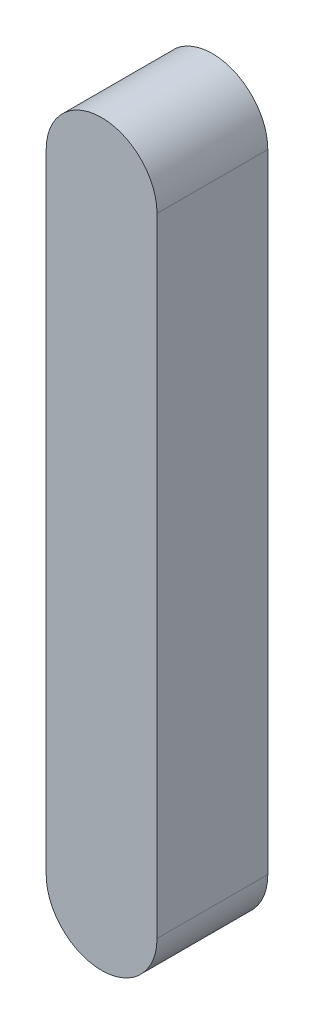
ISO-10303-21;
HEADER;
FILE_DESCRIPTION(('STEP AP214'),'2;1');
FILE_NAME('part.step','',(''),(''),'','','');
FILE_SCHEMA(('AUTOMOTIVE_DESIGN { 1 0 10303 214 1 1 1 1 }'));
ENDSEC;
DATA;
#1=APPLICATION_CONTEXT('core data for automotive mechanical design processes');
#2=APPLICATION_PROTOCOL_DEFINITION('international standard','automotive_design',2000,#1);
#3=PRODUCT_CONTEXT('',#1,'mechanical');
#4=PRODUCT('Part','Part','',(#3));
#5=PRODUCT_RELATED_PRODUCT_CATEGORY('part','',(#4));
#6=PRODUCT_DEFINITION_FORMATION('','',#4);
#7=PRODUCT_DEFINITION_CONTEXT('part definition',#1,'design');
#8=PRODUCT_DEFINITION('design','',#6,#7);
#9=PRODUCT_DEFINITION_SHAPE('','',#8);
#10=(LENGTH_UNIT() NAMED_UNIT(*) SI_UNIT(.MILLI.,.METRE.));
#11=(NAMED_UNIT(*) PLANE_ANGLE_UNIT() SI_UNIT($,.RADIAN.));
#12=(NAMED_UNIT(*) SI_UNIT($,.STERADIAN.) SOLID_ANGLE_UNIT());
#13=UNCERTAINTY_MEASURE_WITH_UNIT(LENGTH_MEASURE(1.E-05),#10,'distance_accuracy_value','');
#14=(GEOMETRIC_REPRESENTATION_CONTEXT(3) GLOBAL_UNCERTAINTY_ASSIGNED_CONTEXT((#13)) GLOBAL_UNIT_ASSIGNED_CONTEXT((#10,
#11,#12)) REPRESENTATION_CONTEXT('',''));
#15=CARTESIAN_POINT('',(0.,0.,0.));
#16=DIRECTION('',(0.,0.,1.));
#17=DIRECTION('',(1.,0.,0.));
#18=AXIS2_PLACEMENT_3D('',#15,#16,#17);
#19=CARTESIAN_POINT('',(80.2001568482512,56.8998914127491,6.));
#20=DIRECTION('',(1.,0.,0.));
#21=DIRECTION('',(0.,0.,-1.));
#22=AXIS2_PLACEMENT_3D('',#19,#20,#21);
#23=PLANE('',#22);
#24=DIRECTION('',(0.,-1.,0.));
#25=VECTOR('',#24,1.);
#26=CARTESIAN_POINT('',(80.2001568482512,56.8998914127491,0.));
#27=LINE('',#26,#25);
#28=CARTESIAN_POINT('',(80.2001568482512,56.8998914127491,0.));
#29=VERTEX_POINT('',#28);
#30=CARTESIAN_POINT('',(80.2001568482512,22.8998914127491,0.));
#31=VERTEX_POINT('',#30);
#32=EDGE_CURVE('E115',#29,#31,#27,.T.);
#33=ORIENTED_EDGE('',*,*,#32,.F.);
#34=DIRECTION('',(0.,0.,-1.));
#35=VECTOR('',#34,1.);
#36=CARTESIAN_POINT('',(80.2001568482512,56.8998914127491,6.));
#37=LINE('',#36,#35);
#38=CARTESIAN_POINT('',(80.2001568482512,56.8998914127491,6.));
#39=VERTEX_POINT('',#38);
#40=EDGE_CURVE('E11',#39,#29,#37,.T.);
#41=ORIENTED_EDGE('',*,*,#40,.F.);
#42=DIRECTION('',(0.,-1.,0.));
#43=VECTOR('',#42,1.);
#44=CARTESIAN_POINT('',(80.2001568482512,56.8998914127491,6.));
#45=LINE('',#44,#43);
#46=CARTESIAN_POINT('',(80.2001568482512,22.8998914127491,6.));
#47=VERTEX_POINT('',#46);
#48=EDGE_CURVE('E108',#39,#47,#45,.T.);
#49=ORIENTED_EDGE('',*,*,#48,.T.);
#50=DIRECTION('',(0.,0.,-1.));
#51=VECTOR('',#50,1.);
#52=CARTESIAN_POINT('',(80.2001568482512,22.8998914127491,6.));
#53=LINE('',#52,#51);
#54=EDGE_CURVE('E39',#47,#31,#53,.T.);
#55=ORIENTED_EDGE('',*,*,#54,.T.);
#56=EDGE_LOOP('',(#33,#41,#49,#55));
#57=FACE_BOUND('',#56,.T.);
#58=ADVANCED_FACE('F36',(#57),#23,.T.);
#59=CARTESIAN_POINT('',(77.2001568482512,56.8998914127491,6.));
#60=DIRECTION('',(0.,0.,-1.));
#61=DIRECTION('',(-1.,0.,0.));
#62=AXIS2_PLACEMENT_3D('',#59,#60,#61);
#63=CYLINDRICAL_SURFACE('',#62,2.99999999999999);
#64=CARTESIAN_POINT('',(77.2001568482512,56.8998914127491,0.));
#65=DIRECTION('',(0.,0.,1.));
#66=DIRECTION('',(1.,0.,0.));
#67=AXIS2_PLACEMENT_3D('',#64,#65,#66);
#68=CIRCLE('',#67,2.99999999999999);
#69=CARTESIAN_POINT('',(74.2001568482512,56.8998914127491,0.));
#70=VERTEX_POINT('',#69);
#71=EDGE_CURVE('E77',#29,#70,#68,.T.);
#72=ORIENTED_EDGE('',*,*,#71,.T.);
#73=DIRECTION('',(0.,0.,-1.));
#74=VECTOR('',#73,1.);
#75=CARTESIAN_POINT('',(74.2001568482512,56.8998914127491,6.));
#76=LINE('',#75,#74);
#77=CARTESIAN_POINT('',(74.2001568482512,56.8998914127491,6.));
#78=VERTEX_POINT('',#77);
#79=EDGE_CURVE('E46',#78,#70,#76,.T.);
#80=ORIENTED_EDGE('',*,*,#79,.F.);
#81=CARTESIAN_POINT('',(77.2001568482512,56.8998914127491,6.));
#82=DIRECTION('',(0.,0.,1.));
#83=DIRECTION('',(1.,0.,0.));
#84=AXIS2_PLACEMENT_3D('',#81,#82,#83);
#85=CIRCLE('',#84,2.99999999999999);
#86=EDGE_CURVE('E93',#39,#78,#85,.T.);
#87=ORIENTED_EDGE('',*,*,#86,.F.);
#88=ORIENTED_EDGE('',*,*,#40,.T.);
#89=EDGE_LOOP('',(#72,#80,#87,#88));
#90=FACE_BOUND('',#89,.T.);
#91=ADVANCED_FACE('F131',(#90),#63,.T.);
#92=CARTESIAN_POINT('',(74.2001568482512,56.8998914127491,6.));
#93=DIRECTION('',(1.,0.,0.));
#94=DIRECTION('',(0.,0.,-1.));
#95=AXIS2_PLACEMENT_3D('',#92,#93,#94);
#96=PLANE('',#95);
#97=DIRECTION('',(0.,-1.,0.));
#98=VECTOR('',#97,1.);
#99=CARTESIAN_POINT('',(74.2001568482512,56.8998914127491,0.));
#100=LINE('',#99,#98);
#101=CARTESIAN_POINT('',(74.2001568482512,22.8998914127491,0.));
#102=VERTEX_POINT('',#101);
#103=EDGE_CURVE('E101',#70,#102,#100,.T.);
#104=ORIENTED_EDGE('',*,*,#103,.T.);
#105=DIRECTION('',(0.,0.,-1.));
#106=VECTOR('',#105,1.);
#107=CARTESIAN_POINT('',(74.2001568482512,22.8998914127491,6.));
#108=LINE('',#107,#106);
#109=CARTESIAN_POINT('',(74.2001568482512,22.8998914127491,6.));
#110=VERTEX_POINT('',#109);
#111=EDGE_CURVE('E98',#110,#102,#108,.T.);
#112=ORIENTED_EDGE('',*,*,#111,.F.);
#113=DIRECTION('',(0.,-1.,0.));
#114=VECTOR('',#113,1.);
#115=CARTESIAN_POINT('',(74.2001568482512,56.8998914127491,6.));
#116=LINE('',#115,#114);
#117=EDGE_CURVE('E90',#78,#110,#116,.T.);
#118=ORIENTED_EDGE('',*,*,#117,.F.);
#119=ORIENTED_EDGE('',*,*,#79,.T.);
#120=EDGE_LOOP('',(#104,#112,#118,#119));
#121=FACE_BOUND('',#120,.T.);
#122=ADVANCED_FACE('F99',(#121),#96,.F.);
#123=CARTESIAN_POINT('',(77.2001568482512,22.8998914127491,6.));
#124=DIRECTION('',(0.,0.,-1.));
#125=DIRECTION('',(-1.,0.,0.));
#126=AXIS2_PLACEMENT_3D('',#123,#124,#125);
#127=CYLINDRICAL_SURFACE('',#126,2.99999999999999);
#128=CARTESIAN_POINT('',(77.2001568482512,22.8998914127491,0.));
#129=DIRECTION('',(0.,0.,1.));
#130=DIRECTION('',(1.,0.,0.));
#131=AXIS2_PLACEMENT_3D('',#128,#129,#130);
#132=CIRCLE('',#131,2.99999999999999);
#133=EDGE_CURVE('E119',#102,#31,#132,.T.);
#134=ORIENTED_EDGE('',*,*,#133,.T.);
#135=ORIENTED_EDGE('',*,*,#54,.F.);
#136=CARTESIAN_POINT('',(77.2001568482512,22.8998914127491,6.));
#137=DIRECTION('',(0.,0.,1.));
#138=DIRECTION('',(1.,0.,0.));
#139=AXIS2_PLACEMENT_3D('',#136,#137,#138);
#140=CIRCLE('',#139,2.99999999999999);
#141=EDGE_CURVE('E86',#110,#47,#140,.T.);
#142=ORIENTED_EDGE('',*,*,#141,.F.);
#143=ORIENTED_EDGE('',*,*,#111,.T.);
#144=EDGE_LOOP('',(#134,#135,#142,#143));
#145=FACE_BOUND('',#144,.T.);
#146=ADVANCED_FACE('F106',(#145),#127,.T.);
#147=CARTESIAN_POINT('',(77.2001568482512,22.8998914127491,6.));
#148=DIRECTION('',(0.,0.,1.));
#149=DIRECTION('',(1.,0.,0.));
#150=AXIS2_PLACEMENT_3D('',#147,#148,#149);
#151=PLANE('',#150);
#152=ORIENTED_EDGE('',*,*,#48,.F.);
#153=ORIENTED_EDGE('',*,*,#86,.T.);
#154=ORIENTED_EDGE('',*,*,#117,.T.);
#155=ORIENTED_EDGE('',*,*,#141,.T.);
#156=EDGE_LOOP('',(#152,#153,#154,#155));
#157=FACE_BOUND('',#156,.T.);
#158=ADVANCED_FACE('F92',(#157),#151,.T.);
#159=CARTESIAN_POINT('',(77.2001568482512,22.8998914127491,0.));
#160=DIRECTION('',(0.,0.,1.));
#161=DIRECTION('',(1.,0.,0.));
#162=AXIS2_PLACEMENT_3D('',#159,#160,#161);
#163=PLANE('',#162);
#164=ORIENTED_EDGE('',*,*,#32,.T.);
#165=ORIENTED_EDGE('',*,*,#133,.F.);
#166=ORIENTED_EDGE('',*,*,#103,.F.);
#167=ORIENTED_EDGE('',*,*,#71,.F.);
#168=EDGE_LOOP('',(#164,#165,#166,#167));
#169=FACE_BOUND('',#168,.T.);
#170=ADVANCED_FACE('F128',(#169),#163,.F.);
#171=CLOSED_SHELL('',(#58,#91,#122,#146,#158,#170));
#172=MANIFOLD_SOLID_BREP('B2',#171);
#173=ADVANCED_BREP_SHAPE_REPRESENTATION('',(#18,#172),#14);
#174=SHAPE_DEFINITION_REPRESENTATION(#9,#173);
ENDSEC;
END-ISO-10303-21;
